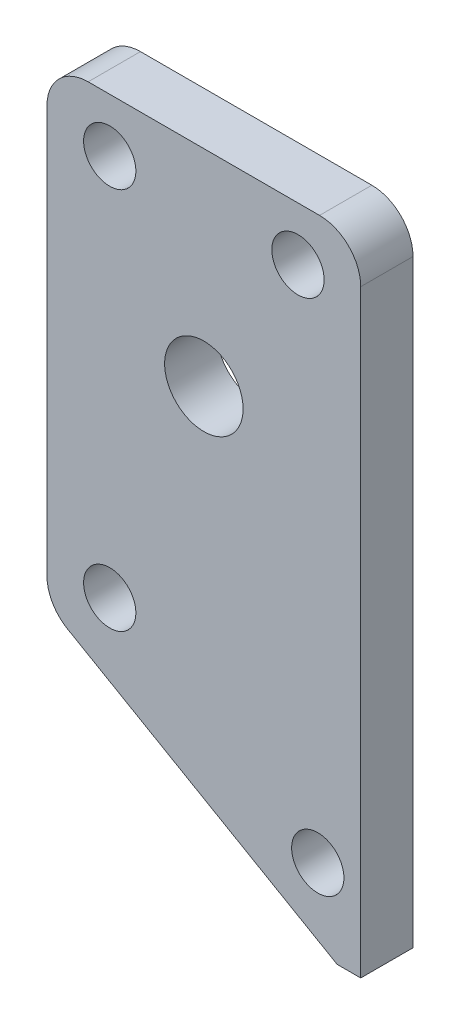
ISO-10303-21;
HEADER;
FILE_DESCRIPTION(('STEP AP214'),'2;1');
FILE_NAME('part.step','',(''),(''),'','','');
FILE_SCHEMA(('AUTOMOTIVE_DESIGN { 1 0 10303 214 1 1 1 1 }'));
ENDSEC;
DATA;
#1=APPLICATION_CONTEXT('core data for automotive mechanical design processes');
#2=APPLICATION_PROTOCOL_DEFINITION('international standard','automotive_design',2000,#1);
#3=PRODUCT_CONTEXT('',#1,'mechanical');
#4=PRODUCT('Part','Part','',(#3));
#5=PRODUCT_RELATED_PRODUCT_CATEGORY('part','',(#4));
#6=PRODUCT_DEFINITION_FORMATION('','',#4);
#7=PRODUCT_DEFINITION_CONTEXT('part definition',#1,'design');
#8=PRODUCT_DEFINITION('design','',#6,#7);
#9=PRODUCT_DEFINITION_SHAPE('','',#8);
#10=(LENGTH_UNIT() NAMED_UNIT(*) SI_UNIT(.MILLI.,.METRE.));
#11=(NAMED_UNIT(*) PLANE_ANGLE_UNIT() SI_UNIT($,.RADIAN.));
#12=(NAMED_UNIT(*) SI_UNIT($,.STERADIAN.) SOLID_ANGLE_UNIT());
#13=UNCERTAINTY_MEASURE_WITH_UNIT(LENGTH_MEASURE(1.E-05),#10,'distance_accuracy_value','');
#14=(GEOMETRIC_REPRESENTATION_CONTEXT(3) GLOBAL_UNCERTAINTY_ASSIGNED_CONTEXT((#13)) GLOBAL_UNIT_ASSIGNED_CONTEXT((#10,
#11,#12)) REPRESENTATION_CONTEXT('',''));
#15=CARTESIAN_POINT('',(0.,0.,0.));
#16=DIRECTION('',(0.,0.,1.));
#17=DIRECTION('',(1.,0.,0.));
#18=AXIS2_PLACEMENT_3D('',#15,#16,#17);
#19=CARTESIAN_POINT('',(0.,0.,6.35));
#20=DIRECTION('',(0.,0.,1.));
#21=DIRECTION('',(1.,0.,0.));
#22=AXIS2_PLACEMENT_3D('',#19,#20,#21);
#23=PLANE('',#22);
#24=CARTESIAN_POINT('',(-11.43,-184.7,6.35));
#25=DIRECTION('',(0.,0.,1.));
#26=DIRECTION('',(1.,0.,0.));
#27=AXIS2_PLACEMENT_3D('',#24,#25,#26);
#28=CIRCLE('',#27,3.175);
#29=CARTESIAN_POINT('',(-8.25500000000003,-184.7,6.35));
#30=VERTEX_POINT('',#29);
#31=EDGE_CURVE('E194',#30,#30,#28,.T.);
#32=ORIENTED_EDGE('',*,*,#31,.F.);
#33=EDGE_LOOP('',(#32));
#34=FACE_BOUND('',#33,.T.);
#35=CARTESIAN_POINT('',(-11.43,-231.16,6.35));
#36=DIRECTION('',(0.,0.,1.));
#37=DIRECTION('',(1.,0.,0.));
#38=AXIS2_PLACEMENT_3D('',#35,#36,#37);
#39=CIRCLE('',#38,3.175);
#40=CARTESIAN_POINT('',(-8.25500000000003,-231.16,6.35));
#41=VERTEX_POINT('',#40);
#42=EDGE_CURVE('E182',#41,#41,#39,.T.);
#43=ORIENTED_EDGE('',*,*,#42,.F.);
#44=EDGE_LOOP('',(#43));
#45=FACE_BOUND('',#44,.T.);
#46=DIRECTION('',(0.,-1.,0.));
#47=VECTOR('',#46,1.);
#48=CARTESIAN_POINT('',(-19.05,-178.2,6.35));
#49=LINE('',#48,#47);
#50=CARTESIAN_POINT('',(-19.05,-183.2,6.35));
#51=VERTEX_POINT('',#50);
#52=CARTESIAN_POINT('',(-19.05,-232.673426119424,6.35));
#53=VERTEX_POINT('',#52);
#54=EDGE_CURVE('E108',#51,#53,#49,.T.);
#55=ORIENTED_EDGE('',*,*,#54,.T.);
#56=CARTESIAN_POINT('',(-14.05,-232.673426119424,6.35));
#57=DIRECTION('',(0.,0.,1.));
#58=DIRECTION('',(1.,0.,0.));
#59=AXIS2_PLACEMENT_3D('',#56,#57,#58);
#60=CIRCLE('',#59,5.);
#61=CARTESIAN_POINT('',(-16.55,-237.003553138346,6.35));
#62=VERTEX_POINT('',#61);
#63=EDGE_CURVE('E104',#53,#62,#60,.T.);
#64=ORIENTED_EDGE('',*,*,#63,.T.);
#65=DIRECTION('',(0.866025403784439,-0.5,0.));
#66=VECTOR('',#65,1.);
#67=CARTESIAN_POINT('',(16.1840702139999,-255.902577388071,6.35));
#68=LINE('',#67,#66);
#69=CARTESIAN_POINT('',(16.1840702139999,-255.902577388071,6.35));
#70=VERTEX_POINT('',#69);
#71=EDGE_CURVE('E96',#62,#70,#68,.T.);
#72=ORIENTED_EDGE('',*,*,#71,.T.);
#73=DIRECTION('',(1.,0.,0.));
#74=VECTOR('',#73,1.);
#75=CARTESIAN_POINT('',(16.1840702139999,-255.902577388071,6.35));
#76=LINE('',#75,#74);
#77=CARTESIAN_POINT('',(19.05,-255.902577388071,6.35));
#78=VERTEX_POINT('',#77);
#79=EDGE_CURVE('E101',#70,#78,#76,.T.);
#80=ORIENTED_EDGE('',*,*,#79,.T.);
#81=DIRECTION('',(0.,1.,0.));
#82=VECTOR('',#81,1.);
#83=CARTESIAN_POINT('',(19.05,-178.2,6.35));
#84=LINE('',#83,#82);
#85=CARTESIAN_POINT('',(19.05,-183.2,6.35));
#86=VERTEX_POINT('',#85);
#87=EDGE_CURVE('E138',#78,#86,#84,.T.);
#88=ORIENTED_EDGE('',*,*,#87,.T.);
#89=CARTESIAN_POINT('',(14.05,-183.2,6.35));
#90=DIRECTION('',(0.,0.,1.));
#91=DIRECTION('',(1.,0.,0.));
#92=AXIS2_PLACEMENT_3D('',#89,#90,#91);
#93=CIRCLE('',#92,5.);
#94=CARTESIAN_POINT('',(14.05,-178.2,6.35));
#95=VERTEX_POINT('',#94);
#96=EDGE_CURVE('E54',#86,#95,#93,.T.);
#97=ORIENTED_EDGE('',*,*,#96,.T.);
#98=DIRECTION('',(-1.,0.,0.));
#99=VECTOR('',#98,1.);
#100=CARTESIAN_POINT('',(-19.05,-178.2,6.35));
#101=LINE('',#100,#99);
#102=CARTESIAN_POINT('',(-14.05,-178.2,6.35));
#103=VERTEX_POINT('',#102);
#104=EDGE_CURVE('E161',#95,#103,#101,.T.);
#105=ORIENTED_EDGE('',*,*,#104,.T.);
#106=CARTESIAN_POINT('',(-14.05,-183.2,6.35));
#107=DIRECTION('',(0.,0.,1.));
#108=DIRECTION('',(1.,0.,0.));
#109=AXIS2_PLACEMENT_3D('',#106,#107,#108);
#110=CIRCLE('',#109,5.);
#111=EDGE_CURVE('E153',#103,#51,#110,.T.);
#112=ORIENTED_EDGE('',*,*,#111,.T.);
#113=EDGE_LOOP('',(#55,#64,#72,#80,#88,#97,#105,#112));
#114=FACE_BOUND('',#113,.T.);
#115=CARTESIAN_POINT('',(13.834070214,-246.4,6.35));
#116=DIRECTION('',(0.,0.,1.));
#117=DIRECTION('',(1.,0.,0.));
#118=AXIS2_PLACEMENT_3D('',#115,#116,#117);
#119=CIRCLE('',#118,3.175);
#120=CARTESIAN_POINT('',(17.009070214,-246.4,6.35));
#121=VERTEX_POINT('',#120);
#122=EDGE_CURVE('E131',#121,#121,#119,.T.);
#123=ORIENTED_EDGE('',*,*,#122,.F.);
#124=EDGE_LOOP('',(#123));
#125=FACE_BOUND('',#124,.T.);
#126=CARTESIAN_POINT('',(0.,-203.2,6.35));
#127=DIRECTION('',(0.,0.,1.));
#128=DIRECTION('',(1.,0.,0.));
#129=AXIS2_PLACEMENT_3D('',#126,#127,#128);
#130=CIRCLE('',#129,4.7625);
#131=CARTESIAN_POINT('',(4.76249999999991,-203.2,6.35));
#132=VERTEX_POINT('',#131);
#133=EDGE_CURVE('E188',#132,#132,#130,.T.);
#134=ORIENTED_EDGE('',*,*,#133,.F.);
#135=EDGE_LOOP('',(#134));
#136=FACE_BOUND('',#135,.T.);
#137=CARTESIAN_POINT('',(11.43,-184.7,6.35));
#138=DIRECTION('',(0.,0.,1.));
#139=DIRECTION('',(1.,0.,0.));
#140=AXIS2_PLACEMENT_3D('',#137,#138,#139);
#141=CIRCLE('',#140,3.175);
#142=CARTESIAN_POINT('',(14.605,-184.7,6.35));
#143=VERTEX_POINT('',#142);
#144=EDGE_CURVE('E200',#143,#143,#141,.T.);
#145=ORIENTED_EDGE('',*,*,#144,.F.);
#146=EDGE_LOOP('',(#145));
#147=FACE_BOUND('',#146,.T.);
#148=ADVANCED_FACE('F33',(#34,#45,#114,#125,#136,#147),#23,.T.);
#149=CARTESIAN_POINT('',(0.,0.,0.));
#150=DIRECTION('',(0.,0.,1.));
#151=DIRECTION('',(1.,0.,0.));
#152=AXIS2_PLACEMENT_3D('',#149,#150,#151);
#153=PLANE('',#152);
#154=DIRECTION('',(0.866025403784439,-0.5,0.));
#155=VECTOR('',#154,1.);
#156=CARTESIAN_POINT('',(16.1840702139999,-255.902577388071,0.));
#157=LINE('',#156,#155);
#158=CARTESIAN_POINT('',(-16.55,-237.003553138346,0.));
#159=VERTEX_POINT('',#158);
#160=CARTESIAN_POINT('',(16.1840702139999,-255.902577388071,0.));
#161=VERTEX_POINT('',#160);
#162=EDGE_CURVE('E114',#159,#161,#157,.T.);
#163=ORIENTED_EDGE('',*,*,#162,.F.);
#164=CARTESIAN_POINT('',(-14.05,-232.673426119424,0.));
#165=DIRECTION('',(0.,0.,1.));
#166=DIRECTION('',(1.,0.,0.));
#167=AXIS2_PLACEMENT_3D('',#164,#165,#166);
#168=CIRCLE('',#167,5.);
#169=CARTESIAN_POINT('',(-19.05,-232.673426119424,0.));
#170=VERTEX_POINT('',#169);
#171=EDGE_CURVE('E145',#159,#170,#168,.F.);
#172=ORIENTED_EDGE('',*,*,#171,.T.);
#173=DIRECTION('',(0.,-1.,0.));
#174=VECTOR('',#173,1.);
#175=CARTESIAN_POINT('',(-19.05,-178.2,0.));
#176=LINE('',#175,#174);
#177=CARTESIAN_POINT('',(-19.05,-183.2,0.));
#178=VERTEX_POINT('',#177);
#179=EDGE_CURVE('E133',#178,#170,#176,.T.);
#180=ORIENTED_EDGE('',*,*,#179,.F.);
#181=CARTESIAN_POINT('',(-14.05,-183.2,0.));
#182=DIRECTION('',(0.,0.,1.));
#183=DIRECTION('',(1.,0.,0.));
#184=AXIS2_PLACEMENT_3D('',#181,#182,#183);
#185=CIRCLE('',#184,5.);
#186=CARTESIAN_POINT('',(-14.05,-178.2,0.));
#187=VERTEX_POINT('',#186);
#188=EDGE_CURVE('E143',#178,#187,#185,.F.);
#189=ORIENTED_EDGE('',*,*,#188,.T.);
#190=DIRECTION('',(-1.,0.,0.));
#191=VECTOR('',#190,1.);
#192=CARTESIAN_POINT('',(-19.05,-178.2,0.));
#193=LINE('',#192,#191);
#194=CARTESIAN_POINT('',(14.05,-178.2,0.));
#195=VERTEX_POINT('',#194);
#196=EDGE_CURVE('E130',#195,#187,#193,.T.);
#197=ORIENTED_EDGE('',*,*,#196,.F.);
#198=CARTESIAN_POINT('',(14.05,-183.2,0.));
#199=DIRECTION('',(0.,0.,1.));
#200=DIRECTION('',(1.,0.,0.));
#201=AXIS2_PLACEMENT_3D('',#198,#199,#200);
#202=CIRCLE('',#201,5.);
#203=CARTESIAN_POINT('',(19.05,-183.2,0.));
#204=VERTEX_POINT('',#203);
#205=EDGE_CURVE('E141',#195,#204,#202,.F.);
#206=ORIENTED_EDGE('',*,*,#205,.T.);
#207=DIRECTION('',(0.,1.,0.));
#208=VECTOR('',#207,1.);
#209=CARTESIAN_POINT('',(19.05,-178.2,0.));
#210=LINE('',#209,#208);
#211=CARTESIAN_POINT('',(19.05,-255.902577388071,0.));
#212=VERTEX_POINT('',#211);
#213=EDGE_CURVE('E127',#212,#204,#210,.T.);
#214=ORIENTED_EDGE('',*,*,#213,.F.);
#215=DIRECTION('',(1.,0.,0.));
#216=VECTOR('',#215,1.);
#217=CARTESIAN_POINT('',(16.1840702139999,-255.902577388071,0.));
#218=LINE('',#217,#216);
#219=EDGE_CURVE('E137',#161,#212,#218,.T.);
#220=ORIENTED_EDGE('',*,*,#219,.F.);
#221=EDGE_LOOP('',(#163,#172,#180,#189,#197,#206,#214,#220));
#222=FACE_BOUND('',#221,.T.);
#223=CARTESIAN_POINT('',(13.834070214,-246.4,0.));
#224=DIRECTION('',(0.,0.,1.));
#225=DIRECTION('',(1.,0.,0.));
#226=AXIS2_PLACEMENT_3D('',#223,#224,#225);
#227=CIRCLE('',#226,3.175);
#228=CARTESIAN_POINT('',(17.009070214,-246.4,0.));
#229=VERTEX_POINT('',#228);
#230=EDGE_CURVE('E179',#229,#229,#227,.T.);
#231=ORIENTED_EDGE('',*,*,#230,.T.);
#232=EDGE_LOOP('',(#231));
#233=FACE_BOUND('',#232,.T.);
#234=CARTESIAN_POINT('',(-11.43,-231.16,0.));
#235=DIRECTION('',(0.,0.,1.));
#236=DIRECTION('',(1.,0.,0.));
#237=AXIS2_PLACEMENT_3D('',#234,#235,#236);
#238=CIRCLE('',#237,3.175);
#239=CARTESIAN_POINT('',(-8.25500000000003,-231.16,0.));
#240=VERTEX_POINT('',#239);
#241=EDGE_CURVE('E185',#240,#240,#238,.T.);
#242=ORIENTED_EDGE('',*,*,#241,.T.);
#243=EDGE_LOOP('',(#242));
#244=FACE_BOUND('',#243,.T.);
#245=CARTESIAN_POINT('',(0.,-203.2,0.));
#246=DIRECTION('',(0.,0.,1.));
#247=DIRECTION('',(1.,0.,0.));
#248=AXIS2_PLACEMENT_3D('',#245,#246,#247);
#249=CIRCLE('',#248,4.7625);
#250=CARTESIAN_POINT('',(4.76249999999991,-203.2,0.));
#251=VERTEX_POINT('',#250);
#252=EDGE_CURVE('E191',#251,#251,#249,.T.);
#253=ORIENTED_EDGE('',*,*,#252,.T.);
#254=EDGE_LOOP('',(#253));
#255=FACE_BOUND('',#254,.T.);
#256=CARTESIAN_POINT('',(-11.43,-184.7,0.));
#257=DIRECTION('',(0.,0.,1.));
#258=DIRECTION('',(1.,0.,0.));
#259=AXIS2_PLACEMENT_3D('',#256,#257,#258);
#260=CIRCLE('',#259,3.175);
#261=CARTESIAN_POINT('',(-8.25500000000003,-184.7,0.));
#262=VERTEX_POINT('',#261);
#263=EDGE_CURVE('E197',#262,#262,#260,.T.);
#264=ORIENTED_EDGE('',*,*,#263,.T.);
#265=EDGE_LOOP('',(#264));
#266=FACE_BOUND('',#265,.T.);
#267=CARTESIAN_POINT('',(11.43,-184.7,0.));
#268=DIRECTION('',(0.,0.,1.));
#269=DIRECTION('',(1.,0.,0.));
#270=AXIS2_PLACEMENT_3D('',#267,#268,#269);
#271=CIRCLE('',#270,3.175);
#272=CARTESIAN_POINT('',(14.605,-184.7,0.));
#273=VERTEX_POINT('',#272);
#274=EDGE_CURVE('E203',#273,#273,#271,.T.);
#275=ORIENTED_EDGE('',*,*,#274,.T.);
#276=EDGE_LOOP('',(#275));
#277=FACE_BOUND('',#276,.T.);
#278=ADVANCED_FACE('F164',(#222,#233,#244,#255,#266,#277),#153,.F.);
#279=CARTESIAN_POINT('',(19.05,-178.2,6.35));
#280=DIRECTION('',(-1.,0.,0.));
#281=DIRECTION('',(0.,0.,1.));
#282=AXIS2_PLACEMENT_3D('',#279,#280,#281);
#283=PLANE('',#282);
#284=ORIENTED_EDGE('',*,*,#213,.T.);
#285=DIRECTION('',(0.,0.,-1.));
#286=VECTOR('',#285,1.);
#287=CARTESIAN_POINT('',(19.05,-183.2,6.35));
#288=LINE('',#287,#286);
#289=EDGE_CURVE('E11',#204,#86,#288,.F.);
#290=ORIENTED_EDGE('',*,*,#289,.T.);
#291=ORIENTED_EDGE('',*,*,#87,.F.);
#292=DIRECTION('',(0.,0.,-1.));
#293=VECTOR('',#292,1.);
#294=CARTESIAN_POINT('',(19.05,-255.902577388071,6.35));
#295=LINE('',#294,#293);
#296=EDGE_CURVE('E118',#78,#212,#295,.T.);
#297=ORIENTED_EDGE('',*,*,#296,.T.);
#298=EDGE_LOOP('',(#284,#290,#291,#297));
#299=FACE_BOUND('',#298,.T.);
#300=ADVANCED_FACE('F218',(#299),#283,.F.);
#301=CARTESIAN_POINT('',(-19.05,-178.2,6.35));
#302=DIRECTION('',(0.,-1.,0.));
#303=DIRECTION('',(0.,0.,-1.));
#304=AXIS2_PLACEMENT_3D('',#301,#302,#303);
#305=PLANE('',#304);
#306=ORIENTED_EDGE('',*,*,#196,.T.);
#307=DIRECTION('',(0.,0.,-1.));
#308=VECTOR('',#307,1.);
#309=CARTESIAN_POINT('',(-14.05,-178.2,6.35));
#310=LINE('',#309,#308);
#311=EDGE_CURVE('E41',#187,#103,#310,.F.);
#312=ORIENTED_EDGE('',*,*,#311,.T.);
#313=ORIENTED_EDGE('',*,*,#104,.F.);
#314=DIRECTION('',(0.,0.,-1.));
#315=VECTOR('',#314,1.);
#316=CARTESIAN_POINT('',(14.05,-178.2,6.35));
#317=LINE('',#316,#315);
#318=EDGE_CURVE('E156',#95,#195,#317,.T.);
#319=ORIENTED_EDGE('',*,*,#318,.T.);
#320=EDGE_LOOP('',(#306,#312,#313,#319));
#321=FACE_BOUND('',#320,.T.);
#322=ADVANCED_FACE('F160',(#321),#305,.F.);
#323=CARTESIAN_POINT('',(-19.05,-178.2,6.35));
#324=DIRECTION('',(1.,0.,0.));
#325=DIRECTION('',(0.,1.,0.));
#326=AXIS2_PLACEMENT_3D('',#323,#324,#325);
#327=PLANE('',#326);
#328=ORIENTED_EDGE('',*,*,#179,.T.);
#329=DIRECTION('',(0.,0.,-1.));
#330=VECTOR('',#329,1.);
#331=CARTESIAN_POINT('',(-19.05,-232.673426119424,6.35));
#332=LINE('',#331,#330);
#333=EDGE_CURVE('E150',#170,#53,#332,.F.);
#334=ORIENTED_EDGE('',*,*,#333,.T.);
#335=ORIENTED_EDGE('',*,*,#54,.F.);
#336=DIRECTION('',(0.,0.,-1.));
#337=VECTOR('',#336,1.);
#338=CARTESIAN_POINT('',(-19.05,-183.2,6.35));
#339=LINE('',#338,#337);
#340=EDGE_CURVE('E147',#51,#178,#339,.T.);
#341=ORIENTED_EDGE('',*,*,#340,.T.);
#342=EDGE_LOOP('',(#328,#334,#335,#341));
#343=FACE_BOUND('',#342,.T.);
#344=ADVANCED_FACE('F174',(#343),#327,.F.);
#345=CARTESIAN_POINT('',(16.1840702139999,-255.902577388071,6.35));
#346=DIRECTION('',(0.5,0.866025403784439,0.));
#347=DIRECTION('',(-0.866025403784439,0.5,0.));
#348=AXIS2_PLACEMENT_3D('',#345,#346,#347);
#349=PLANE('',#348);
#350=ORIENTED_EDGE('',*,*,#71,.F.);
#351=DIRECTION('',(0.,0.,-1.));
#352=VECTOR('',#351,1.);
#353=CARTESIAN_POINT('',(-16.55,-237.003553138346,6.35));
#354=LINE('',#353,#352);
#355=EDGE_CURVE('E117',#62,#159,#354,.T.);
#356=ORIENTED_EDGE('',*,*,#355,.T.);
#357=ORIENTED_EDGE('',*,*,#162,.T.);
#358=DIRECTION('',(0.,0.,-1.));
#359=VECTOR('',#358,1.);
#360=CARTESIAN_POINT('',(16.1840702139999,-255.902577388071,6.35));
#361=LINE('',#360,#359);
#362=EDGE_CURVE('E111',#70,#161,#361,.T.);
#363=ORIENTED_EDGE('',*,*,#362,.F.);
#364=EDGE_LOOP('',(#350,#356,#357,#363));
#365=FACE_BOUND('',#364,.T.);
#366=ADVANCED_FACE('F112',(#365),#349,.F.);
#367=CARTESIAN_POINT('',(16.1840702139999,-255.902577388071,6.35));
#368=DIRECTION('',(0.,1.,0.));
#369=DIRECTION('',(-1.,0.,0.));
#370=AXIS2_PLACEMENT_3D('',#367,#368,#369);
#371=PLANE('',#370);
#372=ORIENTED_EDGE('',*,*,#219,.T.);
#373=ORIENTED_EDGE('',*,*,#296,.F.);
#374=ORIENTED_EDGE('',*,*,#79,.F.);
#375=ORIENTED_EDGE('',*,*,#362,.T.);
#376=EDGE_LOOP('',(#372,#373,#374,#375));
#377=FACE_BOUND('',#376,.T.);
#378=ADVANCED_FACE('F120',(#377),#371,.F.);
#379=CARTESIAN_POINT('',(13.834070214,-246.4,6.35));
#380=DIRECTION('',(0.,0.,-1.));
#381=DIRECTION('',(-1.,0.,0.));
#382=AXIS2_PLACEMENT_3D('',#379,#380,#381);
#383=CYLINDRICAL_SURFACE('',#382,3.175);
#384=ORIENTED_EDGE('',*,*,#122,.T.);
#385=EDGE_LOOP('',(#384));
#386=FACE_BOUND('',#385,.T.);
#387=ORIENTED_EDGE('',*,*,#230,.F.);
#388=EDGE_LOOP('',(#387));
#389=FACE_BOUND('',#388,.T.);
#390=ADVANCED_FACE('F223',(#386,#389),#383,.F.);
#391=CARTESIAN_POINT('',(-11.43,-231.16,6.35));
#392=DIRECTION('',(0.,0.,-1.));
#393=DIRECTION('',(-1.,0.,0.));
#394=AXIS2_PLACEMENT_3D('',#391,#392,#393);
#395=CYLINDRICAL_SURFACE('',#394,3.175);
#396=ORIENTED_EDGE('',*,*,#42,.T.);
#397=EDGE_LOOP('',(#396));
#398=FACE_BOUND('',#397,.T.);
#399=ORIENTED_EDGE('',*,*,#241,.F.);
#400=EDGE_LOOP('',(#399));
#401=FACE_BOUND('',#400,.T.);
#402=ADVANCED_FACE('F320',(#398,#401),#395,.F.);
#403=CARTESIAN_POINT('',(0.,-203.2,6.35));
#404=DIRECTION('',(0.,0.,-1.));
#405=DIRECTION('',(-1.,0.,0.));
#406=AXIS2_PLACEMENT_3D('',#403,#404,#405);
#407=CYLINDRICAL_SURFACE('',#406,4.7625);
#408=ORIENTED_EDGE('',*,*,#133,.T.);
#409=EDGE_LOOP('',(#408));
#410=FACE_BOUND('',#409,.T.);
#411=ORIENTED_EDGE('',*,*,#252,.F.);
#412=EDGE_LOOP('',(#411));
#413=FACE_BOUND('',#412,.T.);
#414=ADVANCED_FACE('F310',(#410,#413),#407,.F.);
#415=CARTESIAN_POINT('',(-11.43,-184.7,6.35));
#416=DIRECTION('',(0.,0.,-1.));
#417=DIRECTION('',(-1.,0.,0.));
#418=AXIS2_PLACEMENT_3D('',#415,#416,#417);
#419=CYLINDRICAL_SURFACE('',#418,3.175);
#420=ORIENTED_EDGE('',*,*,#31,.T.);
#421=EDGE_LOOP('',(#420));
#422=FACE_BOUND('',#421,.T.);
#423=ORIENTED_EDGE('',*,*,#263,.F.);
#424=EDGE_LOOP('',(#423));
#425=FACE_BOUND('',#424,.T.);
#426=ADVANCED_FACE('F301',(#422,#425),#419,.F.);
#427=CARTESIAN_POINT('',(11.43,-184.7,6.35));
#428=DIRECTION('',(0.,0.,-1.));
#429=DIRECTION('',(-1.,0.,0.));
#430=AXIS2_PLACEMENT_3D('',#427,#428,#429);
#431=CYLINDRICAL_SURFACE('',#430,3.175);
#432=ORIENTED_EDGE('',*,*,#144,.T.);
#433=EDGE_LOOP('',(#432));
#434=FACE_BOUND('',#433,.T.);
#435=ORIENTED_EDGE('',*,*,#274,.F.);
#436=EDGE_LOOP('',(#435));
#437=FACE_BOUND('',#436,.T.);
#438=ADVANCED_FACE('F209',(#434,#437),#431,.F.);
#439=CARTESIAN_POINT('',(-14.05,-232.673426119424,6.35));
#440=DIRECTION('',(0.,0.,-1.));
#441=DIRECTION('',(-1.,0.,0.));
#442=AXIS2_PLACEMENT_3D('',#439,#440,#441);
#443=CYLINDRICAL_SURFACE('',#442,5.);
#444=ORIENTED_EDGE('',*,*,#63,.F.);
#445=ORIENTED_EDGE('',*,*,#333,.F.);
#446=ORIENTED_EDGE('',*,*,#171,.F.);
#447=ORIENTED_EDGE('',*,*,#355,.F.);
#448=EDGE_LOOP('',(#444,#445,#446,#447));
#449=FACE_BOUND('',#448,.T.);
#450=ADVANCED_FACE('F237',(#449),#443,.T.);
#451=CARTESIAN_POINT('',(-14.05,-183.2,6.35));
#452=DIRECTION('',(0.,0.,-1.));
#453=DIRECTION('',(-1.,0.,0.));
#454=AXIS2_PLACEMENT_3D('',#451,#452,#453);
#455=CYLINDRICAL_SURFACE('',#454,5.);
#456=ORIENTED_EDGE('',*,*,#111,.F.);
#457=ORIENTED_EDGE('',*,*,#311,.F.);
#458=ORIENTED_EDGE('',*,*,#188,.F.);
#459=ORIENTED_EDGE('',*,*,#340,.F.);
#460=EDGE_LOOP('',(#456,#457,#458,#459));
#461=FACE_BOUND('',#460,.T.);
#462=ADVANCED_FACE('F171',(#461),#455,.T.);
#463=CARTESIAN_POINT('',(14.05,-183.2,6.35));
#464=DIRECTION('',(0.,0.,-1.));
#465=DIRECTION('',(-1.,0.,0.));
#466=AXIS2_PLACEMENT_3D('',#463,#464,#465);
#467=CYLINDRICAL_SURFACE('',#466,5.);
#468=ORIENTED_EDGE('',*,*,#96,.F.);
#469=ORIENTED_EDGE('',*,*,#289,.F.);
#470=ORIENTED_EDGE('',*,*,#205,.F.);
#471=ORIENTED_EDGE('',*,*,#318,.F.);
#472=EDGE_LOOP('',(#468,#469,#470,#471));
#473=FACE_BOUND('',#472,.T.);
#474=ADVANCED_FACE('F35',(#473),#467,.T.);
#475=CLOSED_SHELL('',(#148,#278,#300,#322,#344,#366,#378,#390,#402,#414,#426,#438,#450,#462,#474));
#476=MANIFOLD_SOLID_BREP('B2',#475);
#477=ADVANCED_BREP_SHAPE_REPRESENTATION('',(#18,#476),#14);
#478=SHAPE_DEFINITION_REPRESENTATION(#9,#477);
ENDSEC;
END-ISO-10303-21;
